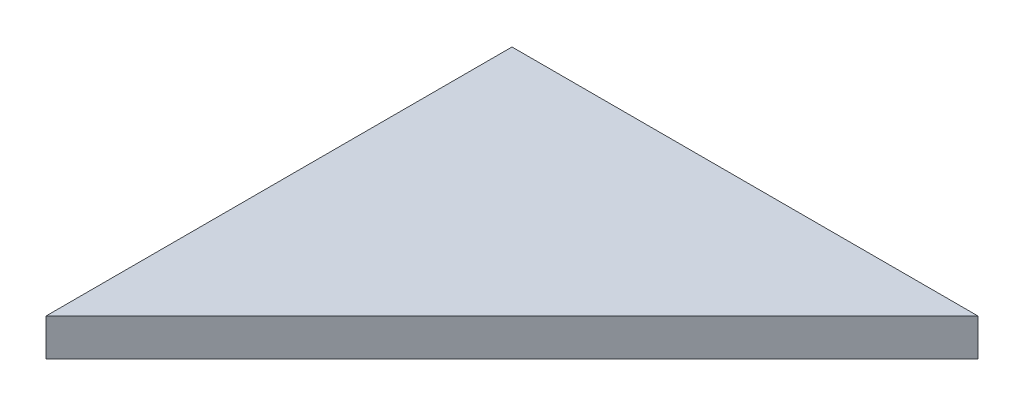
ISO-10303-21;
HEADER;
FILE_DESCRIPTION(('STEP AP214'),'2;1');
FILE_NAME('part.step','',(''),(''),'','','');
FILE_SCHEMA(('AUTOMOTIVE_DESIGN { 1 0 10303 214 1 1 1 1 }'));
ENDSEC;
DATA;
#1=APPLICATION_CONTEXT('core data for automotive mechanical design processes');
#2=APPLICATION_PROTOCOL_DEFINITION('international standard','automotive_design',2000,#1);
#3=PRODUCT_CONTEXT('',#1,'mechanical');
#4=PRODUCT('Part','Part','',(#3));
#5=PRODUCT_RELATED_PRODUCT_CATEGORY('part','',(#4));
#6=PRODUCT_DEFINITION_FORMATION('','',#4);
#7=PRODUCT_DEFINITION_CONTEXT('part definition',#1,'design');
#8=PRODUCT_DEFINITION('design','',#6,#7);
#9=PRODUCT_DEFINITION_SHAPE('','',#8);
#10=(LENGTH_UNIT() NAMED_UNIT(*) SI_UNIT(.MILLI.,.METRE.));
#11=(NAMED_UNIT(*) PLANE_ANGLE_UNIT() SI_UNIT($,.RADIAN.));
#12=(NAMED_UNIT(*) SI_UNIT($,.STERADIAN.) SOLID_ANGLE_UNIT());
#13=UNCERTAINTY_MEASURE_WITH_UNIT(LENGTH_MEASURE(1.E-05),#10,'distance_accuracy_value','');
#14=(GEOMETRIC_REPRESENTATION_CONTEXT(3) GLOBAL_UNCERTAINTY_ASSIGNED_CONTEXT((#13)) GLOBAL_UNIT_ASSIGNED_CONTEXT((#10,
#11,#12)) REPRESENTATION_CONTEXT('',''));
#15=CARTESIAN_POINT('',(0.,0.,0.));
#16=DIRECTION('',(0.,0.,1.));
#17=DIRECTION('',(1.,0.,0.));
#18=AXIS2_PLACEMENT_3D('',#15,#16,#17);
#19=CARTESIAN_POINT('',(80.,0.,-100.));
#20=DIRECTION('',(0.,0.,-1.));
#21=DIRECTION('',(-1.,0.,0.));
#22=AXIS2_PLACEMENT_3D('',#19,#20,#21);
#23=PLANE('',#22);
#24=DIRECTION('',(-1.,0.,0.));
#25=VECTOR('',#24,1.);
#26=CARTESIAN_POINT('',(80.,6.4,-100.));
#27=LINE('',#26,#25);
#28=CARTESIAN_POINT('',(80.,6.4,-100.));
#29=VERTEX_POINT('',#28);
#30=CARTESIAN_POINT('',(0.,6.4,-100.));
#31=VERTEX_POINT('',#30);
#32=EDGE_CURVE('E85',#29,#31,#27,.T.);
#33=ORIENTED_EDGE('',*,*,#32,.F.);
#34=DIRECTION('',(0.,1.,0.));
#35=VECTOR('',#34,1.);
#36=CARTESIAN_POINT('',(80.,0.,-100.));
#37=LINE('',#36,#35);
#38=CARTESIAN_POINT('',(80.,0.,-100.));
#39=VERTEX_POINT('',#38);
#40=EDGE_CURVE('E11',#39,#29,#37,.T.);
#41=ORIENTED_EDGE('',*,*,#40,.F.);
#42=DIRECTION('',(-1.,0.,0.));
#43=VECTOR('',#42,1.);
#44=CARTESIAN_POINT('',(80.,0.,-100.));
#45=LINE('',#44,#43);
#46=CARTESIAN_POINT('',(0.,0.,-100.));
#47=VERTEX_POINT('',#46);
#48=EDGE_CURVE('E77',#39,#47,#45,.T.);
#49=ORIENTED_EDGE('',*,*,#48,.T.);
#50=DIRECTION('',(0.,1.,0.));
#51=VECTOR('',#50,1.);
#52=CARTESIAN_POINT('',(0.,0.,-100.));
#53=LINE('',#52,#51);
#54=EDGE_CURVE('E36',#47,#31,#53,.T.);
#55=ORIENTED_EDGE('',*,*,#54,.T.);
#56=EDGE_LOOP('',(#33,#41,#49,#55));
#57=FACE_BOUND('',#56,.T.);
#58=ADVANCED_FACE('F33',(#57),#23,.T.);
#59=CARTESIAN_POINT('',(0.,0.,-20.));
#60=DIRECTION('',(0.707106781186548,0.,0.707106781186548));
#61=DIRECTION('',(0.707106781186548,0.,-0.707106781186547));
#62=AXIS2_PLACEMENT_3D('',#59,#60,#61);
#63=PLANE('',#62);
#64=DIRECTION('',(0.707106781186548,0.,-0.707106781186547));
#65=VECTOR('',#64,1.);
#66=CARTESIAN_POINT('',(0.,6.4,-20.));
#67=LINE('',#66,#65);
#68=CARTESIAN_POINT('',(0.,6.4,-20.));
#69=VERTEX_POINT('',#68);
#70=EDGE_CURVE('E79',#69,#29,#67,.T.);
#71=ORIENTED_EDGE('',*,*,#70,.F.);
#72=DIRECTION('',(0.,1.,0.));
#73=VECTOR('',#72,1.);
#74=CARTESIAN_POINT('',(0.,0.,-20.));
#75=LINE('',#74,#73);
#76=CARTESIAN_POINT('',(0.,0.,-20.));
#77=VERTEX_POINT('',#76);
#78=EDGE_CURVE('E42',#77,#69,#75,.T.);
#79=ORIENTED_EDGE('',*,*,#78,.F.);
#80=DIRECTION('',(0.707106781186548,0.,-0.707106781186547));
#81=VECTOR('',#80,1.);
#82=CARTESIAN_POINT('',(0.,0.,-20.));
#83=LINE('',#82,#81);
#84=EDGE_CURVE('E74',#77,#39,#83,.T.);
#85=ORIENTED_EDGE('',*,*,#84,.T.);
#86=ORIENTED_EDGE('',*,*,#40,.T.);
#87=EDGE_LOOP('',(#71,#79,#85,#86));
#88=FACE_BOUND('',#87,.T.);
#89=ADVANCED_FACE('F89',(#88),#63,.T.);
#90=CARTESIAN_POINT('',(0.,0.,-100.));
#91=DIRECTION('',(-1.,0.,0.));
#92=DIRECTION('',(0.,0.,1.));
#93=AXIS2_PLACEMENT_3D('',#90,#91,#92);
#94=PLANE('',#93);
#95=DIRECTION('',(0.,0.,1.));
#96=VECTOR('',#95,1.);
#97=CARTESIAN_POINT('',(0.,6.4,-100.));
#98=LINE('',#97,#96);
#99=EDGE_CURVE('E72',#31,#69,#98,.T.);
#100=ORIENTED_EDGE('',*,*,#99,.F.);
#101=ORIENTED_EDGE('',*,*,#54,.F.);
#102=DIRECTION('',(0.,0.,1.));
#103=VECTOR('',#102,1.);
#104=CARTESIAN_POINT('',(0.,0.,-100.));
#105=LINE('',#104,#103);
#106=EDGE_CURVE('E70',#47,#77,#105,.T.);
#107=ORIENTED_EDGE('',*,*,#106,.T.);
#108=ORIENTED_EDGE('',*,*,#78,.T.);
#109=EDGE_LOOP('',(#100,#101,#107,#108));
#110=FACE_BOUND('',#109,.T.);
#111=ADVANCED_FACE('F69',(#110),#94,.T.);
#112=CARTESIAN_POINT('',(0.,0.,0.));
#113=DIRECTION('',(0.,1.,0.));
#114=DIRECTION('',(0.,0.,1.));
#115=AXIS2_PLACEMENT_3D('',#112,#113,#114);
#116=PLANE('',#115);
#117=ORIENTED_EDGE('',*,*,#48,.F.);
#118=ORIENTED_EDGE('',*,*,#84,.F.);
#119=ORIENTED_EDGE('',*,*,#106,.F.);
#120=EDGE_LOOP('',(#117,#118,#119));
#121=FACE_BOUND('',#120,.T.);
#122=ADVANCED_FACE('F76',(#121),#116,.F.);
#123=CARTESIAN_POINT('',(0.,6.4,0.));
#124=DIRECTION('',(0.,1.,0.));
#125=DIRECTION('',(0.,0.,1.));
#126=AXIS2_PLACEMENT_3D('',#123,#124,#125);
#127=PLANE('',#126);
#128=ORIENTED_EDGE('',*,*,#32,.T.);
#129=ORIENTED_EDGE('',*,*,#99,.T.);
#130=ORIENTED_EDGE('',*,*,#70,.T.);
#131=EDGE_LOOP('',(#128,#129,#130));
#132=FACE_BOUND('',#131,.T.);
#133=ADVANCED_FACE('F88',(#132),#127,.T.);
#134=CLOSED_SHELL('',(#58,#89,#111,#122,#133));
#135=MANIFOLD_SOLID_BREP('B2',#134);
#136=ADVANCED_BREP_SHAPE_REPRESENTATION('',(#18,#135),#14);
#137=SHAPE_DEFINITION_REPRESENTATION(#9,#136);
ENDSEC;
END-ISO-10303-21;
